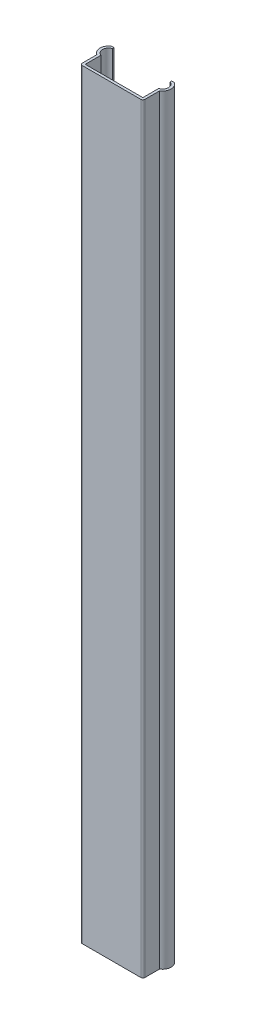
ISO-10303-21;
HEADER;
FILE_DESCRIPTION(('STEP AP214'),'2;1');
FILE_NAME('part.step','',(''),(''),'','','');
FILE_SCHEMA(('AUTOMOTIVE_DESIGN { 1 0 10303 214 1 1 1 1 }'));
ENDSEC;
DATA;
#1=APPLICATION_CONTEXT('core data for automotive mechanical design processes');
#2=APPLICATION_PROTOCOL_DEFINITION('international standard','automotive_design',2000,#1);
#3=PRODUCT_CONTEXT('',#1,'mechanical');
#4=PRODUCT('Part','Part','',(#3));
#5=PRODUCT_RELATED_PRODUCT_CATEGORY('part','',(#4));
#6=PRODUCT_DEFINITION_FORMATION('','',#4);
#7=PRODUCT_DEFINITION_CONTEXT('part definition',#1,'design');
#8=PRODUCT_DEFINITION('design','',#6,#7);
#9=PRODUCT_DEFINITION_SHAPE('','',#8);
#10=(LENGTH_UNIT() NAMED_UNIT(*) SI_UNIT(.MILLI.,.METRE.));
#11=(NAMED_UNIT(*) PLANE_ANGLE_UNIT() SI_UNIT($,.RADIAN.));
#12=(NAMED_UNIT(*) SI_UNIT($,.STERADIAN.) SOLID_ANGLE_UNIT());
#13=UNCERTAINTY_MEASURE_WITH_UNIT(LENGTH_MEASURE(1.E-05),#10,'distance_accuracy_value','');
#14=(GEOMETRIC_REPRESENTATION_CONTEXT(3) GLOBAL_UNCERTAINTY_ASSIGNED_CONTEXT((#13)) GLOBAL_UNIT_ASSIGNED_CONTEXT((#10,
#11,#12)) REPRESENTATION_CONTEXT('',''));
#15=CARTESIAN_POINT('',(0.,0.,0.));
#16=DIRECTION('',(0.,0.,1.));
#17=DIRECTION('',(1.,0.,0.));
#18=AXIS2_PLACEMENT_3D('',#15,#16,#17);
#19=CARTESIAN_POINT('',(-7.5,182.,0.));
#20=DIRECTION('',(1.,0.,0.));
#21=DIRECTION('',(0.,0.,-1.));
#22=AXIS2_PLACEMENT_3D('',#19,#20,#21);
#23=PLANE('',#22);
#24=DIRECTION('',(0.,0.,1.));
#25=VECTOR('',#24,1.);
#26=CARTESIAN_POINT('',(-7.5,0.,0.));
#27=LINE('',#26,#25);
#28=CARTESIAN_POINT('',(-7.5,0.,-4.));
#29=VERTEX_POINT('',#28);
#30=CARTESIAN_POINT('',(-7.5,0.,-0.499999999999999));
#31=VERTEX_POINT('',#30);
#32=EDGE_CURVE('E190',#29,#31,#27,.T.);
#33=ORIENTED_EDGE('',*,*,#32,.T.);
#34=DIRECTION('',(0.,-1.,0.));
#35=VECTOR('',#34,1.);
#36=CARTESIAN_POINT('',(-7.5,182.,-0.499999999999999));
#37=LINE('',#36,#35);
#38=CARTESIAN_POINT('',(-7.5,182.,-0.499999999999999));
#39=VERTEX_POINT('',#38);
#40=EDGE_CURVE('E53',#31,#39,#37,.F.);
#41=ORIENTED_EDGE('',*,*,#40,.T.);
#42=DIRECTION('',(0.,0.,1.));
#43=VECTOR('',#42,1.);
#44=CARTESIAN_POINT('',(-7.5,182.,0.));
#45=LINE('',#44,#43);
#46=CARTESIAN_POINT('',(-7.5,182.,-4.));
#47=VERTEX_POINT('',#46);
#48=EDGE_CURVE('E218',#47,#39,#45,.T.);
#49=ORIENTED_EDGE('',*,*,#48,.F.);
#50=DIRECTION('',(0.,-1.,0.));
#51=VECTOR('',#50,1.);
#52=CARTESIAN_POINT('',(-7.5,182.,-4.));
#53=LINE('',#52,#51);
#54=EDGE_CURVE('E189',#47,#29,#53,.T.);
#55=ORIENTED_EDGE('',*,*,#54,.T.);
#56=EDGE_LOOP('',(#33,#41,#49,#55));
#57=FACE_BOUND('',#56,.T.);
#58=ADVANCED_FACE('F30',(#57),#23,.F.);
#59=CARTESIAN_POINT('',(7.5,182.,0.));
#60=DIRECTION('',(0.,0.,-1.));
#61=DIRECTION('',(-1.,0.,0.));
#62=AXIS2_PLACEMENT_3D('',#59,#60,#61);
#63=PLANE('',#62);
#64=DIRECTION('',(1.,0.,0.));
#65=VECTOR('',#64,1.);
#66=CARTESIAN_POINT('',(7.5,182.,0.));
#67=LINE('',#66,#65);
#68=CARTESIAN_POINT('',(-7.,182.,0.));
#69=VERTEX_POINT('',#68);
#70=CARTESIAN_POINT('',(7.,182.,0.));
#71=VERTEX_POINT('',#70);
#72=EDGE_CURVE('E151',#69,#71,#67,.T.);
#73=ORIENTED_EDGE('',*,*,#72,.F.);
#74=DIRECTION('',(0.,-1.,0.));
#75=VECTOR('',#74,1.);
#76=CARTESIAN_POINT('',(-7.,182.,0.));
#77=LINE('',#76,#75);
#78=CARTESIAN_POINT('',(-7.,0.,0.));
#79=VERTEX_POINT('',#78);
#80=EDGE_CURVE('E250',#69,#79,#77,.T.);
#81=ORIENTED_EDGE('',*,*,#80,.T.);
#82=DIRECTION('',(1.,0.,0.));
#83=VECTOR('',#82,1.);
#84=CARTESIAN_POINT('',(7.5,0.,0.));
#85=LINE('',#84,#83);
#86=CARTESIAN_POINT('',(7.,0.,0.));
#87=VERTEX_POINT('',#86);
#88=EDGE_CURVE('E192',#79,#87,#85,.T.);
#89=ORIENTED_EDGE('',*,*,#88,.T.);
#90=DIRECTION('',(0.,-1.,0.));
#91=VECTOR('',#90,1.);
#92=CARTESIAN_POINT('',(7.,182.,0.));
#93=LINE('',#92,#91);
#94=EDGE_CURVE('E160',#87,#71,#93,.F.);
#95=ORIENTED_EDGE('',*,*,#94,.T.);
#96=EDGE_LOOP('',(#73,#81,#89,#95));
#97=FACE_BOUND('',#96,.T.);
#98=ADVANCED_FACE('F263',(#97),#63,.F.);
#99=CARTESIAN_POINT('',(7.5,182.,0.));
#100=DIRECTION('',(-1.,0.,0.));
#101=DIRECTION('',(0.,0.,1.));
#102=AXIS2_PLACEMENT_3D('',#99,#100,#101);
#103=PLANE('',#102);
#104=DIRECTION('',(0.,0.,-1.));
#105=VECTOR('',#104,1.);
#106=CARTESIAN_POINT('',(7.5,182.,0.));
#107=LINE('',#106,#105);
#108=CARTESIAN_POINT('',(7.5,182.,-0.499999999999999));
#109=VERTEX_POINT('',#108);
#110=CARTESIAN_POINT('',(7.5,182.,-4.));
#111=VERTEX_POINT('',#110);
#112=EDGE_CURVE('E143',#109,#111,#107,.T.);
#113=ORIENTED_EDGE('',*,*,#112,.F.);
#114=DIRECTION('',(0.,-1.,0.));
#115=VECTOR('',#114,1.);
#116=CARTESIAN_POINT('',(7.5,182.,-0.499999999999999));
#117=LINE('',#116,#115);
#118=CARTESIAN_POINT('',(7.5,0.,-0.499999999999999));
#119=VERTEX_POINT('',#118);
#120=EDGE_CURVE('E11',#109,#119,#117,.T.);
#121=ORIENTED_EDGE('',*,*,#120,.T.);
#122=DIRECTION('',(0.,0.,-1.));
#123=VECTOR('',#122,1.);
#124=CARTESIAN_POINT('',(7.5,0.,0.));
#125=LINE('',#124,#123);
#126=CARTESIAN_POINT('',(7.5,0.,-4.));
#127=VERTEX_POINT('',#126);
#128=EDGE_CURVE('E157',#119,#127,#125,.T.);
#129=ORIENTED_EDGE('',*,*,#128,.T.);
#130=DIRECTION('',(0.,-1.,0.));
#131=VECTOR('',#130,1.);
#132=CARTESIAN_POINT('',(7.5,182.,-4.));
#133=LINE('',#132,#131);
#134=EDGE_CURVE('E154',#111,#127,#133,.T.);
#135=ORIENTED_EDGE('',*,*,#134,.F.);
#136=EDGE_LOOP('',(#113,#121,#129,#135));
#137=FACE_BOUND('',#136,.T.);
#138=ADVANCED_FACE('F155',(#137),#103,.F.);
#139=CARTESIAN_POINT('',(6.46875,182.,-5.75));
#140=DIRECTION('',(0.,-1.,0.));
#141=DIRECTION('',(0.,0.,-1.));
#142=AXIS2_PLACEMENT_3D('',#139,#140,#141);
#143=CYLINDRICAL_SURFACE('',#142,2.03125);
#144=CARTESIAN_POINT('',(6.46875,0.,-5.75));
#145=DIRECTION('',(0.,1.,0.));
#146=DIRECTION('',(0.,0.,1.));
#147=AXIS2_PLACEMENT_3D('',#144,#145,#146);
#148=CIRCLE('',#147,2.03125);
#149=CARTESIAN_POINT('',(7.5,0.,-7.5));
#150=VERTEX_POINT('',#149);
#151=EDGE_CURVE('E196',#127,#150,#148,.T.);
#152=ORIENTED_EDGE('',*,*,#151,.T.);
#153=DIRECTION('',(0.,-1.,0.));
#154=VECTOR('',#153,1.);
#155=CARTESIAN_POINT('',(7.5,182.,-7.5));
#156=LINE('',#155,#154);
#157=CARTESIAN_POINT('',(7.5,182.,-7.5));
#158=VERTEX_POINT('',#157);
#159=EDGE_CURVE('E161',#158,#150,#156,.T.);
#160=ORIENTED_EDGE('',*,*,#159,.F.);
#161=CARTESIAN_POINT('',(6.46875,182.,-5.75));
#162=DIRECTION('',(0.,1.,0.));
#163=DIRECTION('',(0.,0.,1.));
#164=AXIS2_PLACEMENT_3D('',#161,#162,#163);
#165=CIRCLE('',#164,2.03125);
#166=EDGE_CURVE('E147',#111,#158,#165,.T.);
#167=ORIENTED_EDGE('',*,*,#166,.F.);
#168=ORIENTED_EDGE('',*,*,#134,.T.);
#169=EDGE_LOOP('',(#152,#160,#167,#168));
#170=FACE_BOUND('',#169,.T.);
#171=ADVANCED_FACE('F163',(#170),#143,.T.);
#172=CARTESIAN_POINT('',(7.5,182.,-7.5));
#173=DIRECTION('',(0.,0.,1.));
#174=DIRECTION('',(1.,0.,0.));
#175=AXIS2_PLACEMENT_3D('',#172,#173,#174);
#176=PLANE('',#175);
#177=DIRECTION('',(-1.,0.,0.));
#178=VECTOR('',#177,1.);
#179=CARTESIAN_POINT('',(7.5,0.,-7.5));
#180=LINE('',#179,#178);
#181=CARTESIAN_POINT('',(6.9,0.,-7.5));
#182=VERTEX_POINT('',#181);
#183=EDGE_CURVE('E198',#150,#182,#180,.T.);
#184=ORIENTED_EDGE('',*,*,#183,.T.);
#185=DIRECTION('',(0.,-1.,0.));
#186=VECTOR('',#185,1.);
#187=CARTESIAN_POINT('',(6.9,182.,-7.5));
#188=LINE('',#187,#186);
#189=CARTESIAN_POINT('',(6.9,182.,-7.5));
#190=VERTEX_POINT('',#189);
#191=EDGE_CURVE('E245',#190,#182,#188,.T.);
#192=ORIENTED_EDGE('',*,*,#191,.F.);
#193=DIRECTION('',(-1.,0.,0.));
#194=VECTOR('',#193,1.);
#195=CARTESIAN_POINT('',(7.5,182.,-7.5));
#196=LINE('',#195,#194);
#197=EDGE_CURVE('E166',#158,#190,#196,.T.);
#198=ORIENTED_EDGE('',*,*,#197,.F.);
#199=ORIENTED_EDGE('',*,*,#159,.T.);
#200=EDGE_LOOP('',(#184,#192,#198,#199));
#201=FACE_BOUND('',#200,.T.);
#202=ADVANCED_FACE('F318',(#201),#176,.F.);
#203=CARTESIAN_POINT('',(6.9,182.,-7.5));
#204=DIRECTION('',(1.,0.,0.));
#205=DIRECTION('',(0.,0.,-1.));
#206=AXIS2_PLACEMENT_3D('',#203,#204,#205);
#207=PLANE('',#206);
#208=DIRECTION('',(0.,0.,1.));
#209=VECTOR('',#208,1.);
#210=CARTESIAN_POINT('',(6.9,0.,-7.5));
#211=LINE('',#210,#209);
#212=CARTESIAN_POINT('',(6.9,0.,-7.11473440639562));
#213=VERTEX_POINT('',#212);
#214=EDGE_CURVE('E200',#182,#213,#211,.T.);
#215=ORIENTED_EDGE('',*,*,#214,.T.);
#216=DIRECTION('',(0.,-1.,0.));
#217=VECTOR('',#216,1.);
#218=CARTESIAN_POINT('',(6.9,182.,-7.11473440639562));
#219=LINE('',#218,#217);
#220=CARTESIAN_POINT('',(6.9,182.,-7.11473440639562));
#221=VERTEX_POINT('',#220);
#222=EDGE_CURVE('E242',#221,#213,#219,.T.);
#223=ORIENTED_EDGE('',*,*,#222,.F.);
#224=DIRECTION('',(0.,0.,1.));
#225=VECTOR('',#224,1.);
#226=CARTESIAN_POINT('',(6.9,182.,-7.5));
#227=LINE('',#226,#225);
#228=EDGE_CURVE('E168',#190,#221,#227,.T.);
#229=ORIENTED_EDGE('',*,*,#228,.F.);
#230=ORIENTED_EDGE('',*,*,#191,.T.);
#231=EDGE_LOOP('',(#215,#223,#229,#230));
#232=FACE_BOUND('',#231,.T.);
#233=ADVANCED_FACE('F315',(#232),#207,.F.);
#234=CARTESIAN_POINT('',(6.46875,182.,-5.75));
#235=DIRECTION('',(0.,-1.,0.));
#236=DIRECTION('',(0.,0.,-1.));
#237=AXIS2_PLACEMENT_3D('',#234,#235,#236);
#238=CYLINDRICAL_SURFACE('',#237,1.43125);
#239=CARTESIAN_POINT('',(6.46875,0.,-5.75));
#240=DIRECTION('',(0.,-1.,0.));
#241=DIRECTION('',(0.,0.,1.));
#242=AXIS2_PLACEMENT_3D('',#239,#240,#241);
#243=CIRCLE('',#242,1.43125);
#244=CARTESIAN_POINT('',(6.9,0.,-4.38526559360438));
#245=VERTEX_POINT('',#244);
#246=EDGE_CURVE('E202',#213,#245,#243,.T.);
#247=ORIENTED_EDGE('',*,*,#246,.T.);
#248=DIRECTION('',(0.,-1.,0.));
#249=VECTOR('',#248,1.);
#250=CARTESIAN_POINT('',(6.9,182.,-4.38526559360438));
#251=LINE('',#250,#249);
#252=CARTESIAN_POINT('',(6.9,182.,-4.38526559360438));
#253=VERTEX_POINT('',#252);
#254=EDGE_CURVE('E239',#253,#245,#251,.T.);
#255=ORIENTED_EDGE('',*,*,#254,.F.);
#256=CARTESIAN_POINT('',(6.46875,182.,-5.75));
#257=DIRECTION('',(0.,-1.,0.));
#258=DIRECTION('',(0.,0.,1.));
#259=AXIS2_PLACEMENT_3D('',#256,#257,#258);
#260=CIRCLE('',#259,1.43125);
#261=EDGE_CURVE('E173',#221,#253,#260,.T.);
#262=ORIENTED_EDGE('',*,*,#261,.F.);
#263=ORIENTED_EDGE('',*,*,#222,.T.);
#264=EDGE_LOOP('',(#247,#255,#262,#263));
#265=FACE_BOUND('',#264,.T.);
#266=ADVANCED_FACE('F310',(#265),#238,.F.);
#267=CARTESIAN_POINT('',(6.9,182.,-0.599999999999999));
#268=DIRECTION('',(1.,0.,0.));
#269=DIRECTION('',(0.,0.,-1.));
#270=AXIS2_PLACEMENT_3D('',#267,#268,#269);
#271=PLANE('',#270);
#272=DIRECTION('',(0.,0.,1.));
#273=VECTOR('',#272,1.);
#274=CARTESIAN_POINT('',(6.9,0.,-0.599999999999999));
#275=LINE('',#274,#273);
#276=CARTESIAN_POINT('',(6.9,0.,-0.599999999999999));
#277=VERTEX_POINT('',#276);
#278=EDGE_CURVE('E204',#245,#277,#275,.T.);
#279=ORIENTED_EDGE('',*,*,#278,.T.);
#280=DIRECTION('',(0.,-1.,0.));
#281=VECTOR('',#280,1.);
#282=CARTESIAN_POINT('',(6.9,182.,-0.599999999999999));
#283=LINE('',#282,#281);
#284=CARTESIAN_POINT('',(6.9,182.,-0.599999999999999));
#285=VERTEX_POINT('',#284);
#286=EDGE_CURVE('E236',#285,#277,#283,.T.);
#287=ORIENTED_EDGE('',*,*,#286,.F.);
#288=DIRECTION('',(0.,0.,1.));
#289=VECTOR('',#288,1.);
#290=CARTESIAN_POINT('',(6.9,182.,-0.599999999999999));
#291=LINE('',#290,#289);
#292=EDGE_CURVE('E175',#253,#285,#291,.T.);
#293=ORIENTED_EDGE('',*,*,#292,.F.);
#294=ORIENTED_EDGE('',*,*,#254,.T.);
#295=EDGE_LOOP('',(#279,#287,#293,#294));
#296=FACE_BOUND('',#295,.T.);
#297=ADVANCED_FACE('F304',(#296),#271,.F.);
#298=CARTESIAN_POINT('',(6.9,182.,-0.599999999999999));
#299=DIRECTION('',(0.,0.,1.));
#300=DIRECTION('',(1.,0.,0.));
#301=AXIS2_PLACEMENT_3D('',#298,#299,#300);
#302=PLANE('',#301);
#303=DIRECTION('',(-1.,0.,0.));
#304=VECTOR('',#303,1.);
#305=CARTESIAN_POINT('',(6.9,0.,-0.599999999999999));
#306=LINE('',#305,#304);
#307=CARTESIAN_POINT('',(-6.9,0.,-0.599999999999999));
#308=VERTEX_POINT('',#307);
#309=EDGE_CURVE('E206',#277,#308,#306,.T.);
#310=ORIENTED_EDGE('',*,*,#309,.T.);
#311=DIRECTION('',(0.,-1.,0.));
#312=VECTOR('',#311,1.);
#313=CARTESIAN_POINT('',(-6.9,182.,-0.599999999999999));
#314=LINE('',#313,#312);
#315=CARTESIAN_POINT('',(-6.9,182.,-0.599999999999999));
#316=VERTEX_POINT('',#315);
#317=EDGE_CURVE('E233',#316,#308,#314,.T.);
#318=ORIENTED_EDGE('',*,*,#317,.F.);
#319=DIRECTION('',(-1.,0.,0.));
#320=VECTOR('',#319,1.);
#321=CARTESIAN_POINT('',(6.9,182.,-0.599999999999999));
#322=LINE('',#321,#320);
#323=EDGE_CURVE('E177',#285,#316,#322,.T.);
#324=ORIENTED_EDGE('',*,*,#323,.F.);
#325=ORIENTED_EDGE('',*,*,#286,.T.);
#326=EDGE_LOOP('',(#310,#318,#324,#325));
#327=FACE_BOUND('',#326,.T.);
#328=ADVANCED_FACE('F300',(#327),#302,.F.);
#329=CARTESIAN_POINT('',(-6.9,182.,-0.599999999999999));
#330=DIRECTION('',(-1.,0.,0.));
#331=DIRECTION('',(0.,0.,1.));
#332=AXIS2_PLACEMENT_3D('',#329,#330,#331);
#333=PLANE('',#332);
#334=DIRECTION('',(0.,0.,-1.));
#335=VECTOR('',#334,1.);
#336=CARTESIAN_POINT('',(-6.9,0.,-0.599999999999999));
#337=LINE('',#336,#335);
#338=CARTESIAN_POINT('',(-6.9,0.,-4.38526559360438));
#339=VERTEX_POINT('',#338);
#340=EDGE_CURVE('E208',#308,#339,#337,.T.);
#341=ORIENTED_EDGE('',*,*,#340,.T.);
#342=DIRECTION('',(0.,-1.,0.));
#343=VECTOR('',#342,1.);
#344=CARTESIAN_POINT('',(-6.9,182.,-4.38526559360438));
#345=LINE('',#344,#343);
#346=CARTESIAN_POINT('',(-6.9,182.,-4.38526559360438));
#347=VERTEX_POINT('',#346);
#348=EDGE_CURVE('E230',#347,#339,#345,.T.);
#349=ORIENTED_EDGE('',*,*,#348,.F.);
#350=DIRECTION('',(0.,0.,-1.));
#351=VECTOR('',#350,1.);
#352=CARTESIAN_POINT('',(-6.9,182.,-0.599999999999999));
#353=LINE('',#352,#351);
#354=EDGE_CURVE('E179',#316,#347,#353,.T.);
#355=ORIENTED_EDGE('',*,*,#354,.F.);
#356=ORIENTED_EDGE('',*,*,#317,.T.);
#357=EDGE_LOOP('',(#341,#349,#355,#356));
#358=FACE_BOUND('',#357,.T.);
#359=ADVANCED_FACE('F295',(#358),#333,.F.);
#360=CARTESIAN_POINT('',(-6.46875,182.,-5.75));
#361=DIRECTION('',(0.,-1.,0.));
#362=DIRECTION('',(0.,0.,-1.));
#363=AXIS2_PLACEMENT_3D('',#360,#361,#362);
#364=CYLINDRICAL_SURFACE('',#363,1.43125);
#365=CARTESIAN_POINT('',(-6.46875,0.,-5.75));
#366=DIRECTION('',(0.,-1.,0.));
#367=DIRECTION('',(0.,0.,-1.));
#368=AXIS2_PLACEMENT_3D('',#365,#366,#367);
#369=CIRCLE('',#368,1.43125);
#370=CARTESIAN_POINT('',(-6.9,0.,-7.11473440639562));
#371=VERTEX_POINT('',#370);
#372=EDGE_CURVE('E210',#339,#371,#369,.T.);
#373=ORIENTED_EDGE('',*,*,#372,.T.);
#374=DIRECTION('',(0.,-1.,0.));
#375=VECTOR('',#374,1.);
#376=CARTESIAN_POINT('',(-6.9,182.,-7.11473440639562));
#377=LINE('',#376,#375);
#378=CARTESIAN_POINT('',(-6.9,182.,-7.11473440639562));
#379=VERTEX_POINT('',#378);
#380=EDGE_CURVE('E227',#379,#371,#377,.T.);
#381=ORIENTED_EDGE('',*,*,#380,.F.);
#382=CARTESIAN_POINT('',(-6.46875,182.,-5.75));
#383=DIRECTION('',(0.,-1.,0.));
#384=DIRECTION('',(0.,0.,-1.));
#385=AXIS2_PLACEMENT_3D('',#382,#383,#384);
#386=CIRCLE('',#385,1.43125);
#387=EDGE_CURVE('E181',#347,#379,#386,.T.);
#388=ORIENTED_EDGE('',*,*,#387,.F.);
#389=ORIENTED_EDGE('',*,*,#348,.T.);
#390=EDGE_LOOP('',(#373,#381,#388,#389));
#391=FACE_BOUND('',#390,.T.);
#392=ADVANCED_FACE('F289',(#391),#364,.F.);
#393=CARTESIAN_POINT('',(-6.9,182.,-7.5));
#394=DIRECTION('',(-1.,0.,0.));
#395=DIRECTION('',(0.,0.,1.));
#396=AXIS2_PLACEMENT_3D('',#393,#394,#395);
#397=PLANE('',#396);
#398=DIRECTION('',(0.,0.,-1.));
#399=VECTOR('',#398,1.);
#400=CARTESIAN_POINT('',(-6.9,0.,-7.5));
#401=LINE('',#400,#399);
#402=CARTESIAN_POINT('',(-6.9,0.,-7.5));
#403=VERTEX_POINT('',#402);
#404=EDGE_CURVE('E212',#371,#403,#401,.T.);
#405=ORIENTED_EDGE('',*,*,#404,.T.);
#406=DIRECTION('',(0.,-1.,0.));
#407=VECTOR('',#406,1.);
#408=CARTESIAN_POINT('',(-6.9,182.,-7.5));
#409=LINE('',#408,#407);
#410=CARTESIAN_POINT('',(-6.9,182.,-7.5));
#411=VERTEX_POINT('',#410);
#412=EDGE_CURVE('E224',#411,#403,#409,.T.);
#413=ORIENTED_EDGE('',*,*,#412,.F.);
#414=DIRECTION('',(0.,0.,-1.));
#415=VECTOR('',#414,1.);
#416=CARTESIAN_POINT('',(-6.9,182.,-7.5));
#417=LINE('',#416,#415);
#418=EDGE_CURVE('E183',#379,#411,#417,.T.);
#419=ORIENTED_EDGE('',*,*,#418,.F.);
#420=ORIENTED_EDGE('',*,*,#380,.T.);
#421=EDGE_LOOP('',(#405,#413,#419,#420));
#422=FACE_BOUND('',#421,.T.);
#423=ADVANCED_FACE('F285',(#422),#397,.F.);
#424=CARTESIAN_POINT('',(-7.5,182.,-7.5));
#425=DIRECTION('',(0.,0.,1.));
#426=DIRECTION('',(1.,0.,0.));
#427=AXIS2_PLACEMENT_3D('',#424,#425,#426);
#428=PLANE('',#427);
#429=DIRECTION('',(-1.,0.,0.));
#430=VECTOR('',#429,1.);
#431=CARTESIAN_POINT('',(-7.5,0.,-7.5));
#432=LINE('',#431,#430);
#433=CARTESIAN_POINT('',(-7.5,0.,-7.5));
#434=VERTEX_POINT('',#433);
#435=EDGE_CURVE('E214',#403,#434,#432,.T.);
#436=ORIENTED_EDGE('',*,*,#435,.T.);
#437=DIRECTION('',(0.,-1.,0.));
#438=VECTOR('',#437,1.);
#439=CARTESIAN_POINT('',(-7.5,182.,-7.5));
#440=LINE('',#439,#438);
#441=CARTESIAN_POINT('',(-7.5,182.,-7.5));
#442=VERTEX_POINT('',#441);
#443=EDGE_CURVE('E221',#442,#434,#440,.T.);
#444=ORIENTED_EDGE('',*,*,#443,.F.);
#445=DIRECTION('',(-1.,0.,0.));
#446=VECTOR('',#445,1.);
#447=CARTESIAN_POINT('',(-7.5,182.,-7.5));
#448=LINE('',#447,#446);
#449=EDGE_CURVE('E185',#411,#442,#448,.T.);
#450=ORIENTED_EDGE('',*,*,#449,.F.);
#451=ORIENTED_EDGE('',*,*,#412,.T.);
#452=EDGE_LOOP('',(#436,#444,#450,#451));
#453=FACE_BOUND('',#452,.T.);
#454=ADVANCED_FACE('F280',(#453),#428,.F.);
#455=CARTESIAN_POINT('',(-6.46875,182.,-5.75));
#456=DIRECTION('',(0.,-1.,0.));
#457=DIRECTION('',(0.,0.,-1.));
#458=AXIS2_PLACEMENT_3D('',#455,#456,#457);
#459=CYLINDRICAL_SURFACE('',#458,2.03125);
#460=CARTESIAN_POINT('',(-6.46875,0.,-5.75));
#461=DIRECTION('',(0.,1.,0.));
#462=DIRECTION('',(0.,0.,-1.));
#463=AXIS2_PLACEMENT_3D('',#460,#461,#462);
#464=CIRCLE('',#463,2.03125);
#465=EDGE_CURVE('E216',#434,#29,#464,.T.);
#466=ORIENTED_EDGE('',*,*,#465,.T.);
#467=ORIENTED_EDGE('',*,*,#54,.F.);
#468=CARTESIAN_POINT('',(-6.46875,182.,-5.75));
#469=DIRECTION('',(0.,1.,0.));
#470=DIRECTION('',(0.,0.,-1.));
#471=AXIS2_PLACEMENT_3D('',#468,#469,#470);
#472=CIRCLE('',#471,2.03125);
#473=EDGE_CURVE('E187',#442,#47,#472,.T.);
#474=ORIENTED_EDGE('',*,*,#473,.F.);
#475=ORIENTED_EDGE('',*,*,#443,.T.);
#476=EDGE_LOOP('',(#466,#467,#474,#475));
#477=FACE_BOUND('',#476,.T.);
#478=ADVANCED_FACE('F274',(#477),#459,.T.);
#479=CARTESIAN_POINT('',(-6.46875,182.,-5.75));
#480=DIRECTION('',(0.,-1.,0.));
#481=DIRECTION('',(0.,0.,-1.));
#482=AXIS2_PLACEMENT_3D('',#479,#480,#481);
#483=PLANE('',#482);
#484=ORIENTED_EDGE('',*,*,#48,.T.);
#485=CARTESIAN_POINT('',(-7.,182.,-0.499999999999999));
#486=DIRECTION('',(0.,-1.,0.));
#487=DIRECTION('',(0.,0.,-1.));
#488=AXIS2_PLACEMENT_3D('',#485,#486,#487);
#489=CIRCLE('',#488,0.5);
#490=EDGE_CURVE('E38',#39,#69,#489,.F.);
#491=ORIENTED_EDGE('',*,*,#490,.T.);
#492=ORIENTED_EDGE('',*,*,#72,.T.);
#493=CARTESIAN_POINT('',(7.,182.,-0.499999999999999));
#494=DIRECTION('',(0.,-1.,0.));
#495=DIRECTION('',(0.,0.,-1.));
#496=AXIS2_PLACEMENT_3D('',#493,#494,#495);
#497=CIRCLE('',#496,0.5);
#498=EDGE_CURVE('E45',#71,#109,#497,.F.);
#499=ORIENTED_EDGE('',*,*,#498,.T.);
#500=ORIENTED_EDGE('',*,*,#112,.T.);
#501=ORIENTED_EDGE('',*,*,#166,.T.);
#502=ORIENTED_EDGE('',*,*,#197,.T.);
#503=ORIENTED_EDGE('',*,*,#228,.T.);
#504=ORIENTED_EDGE('',*,*,#261,.T.);
#505=ORIENTED_EDGE('',*,*,#292,.T.);
#506=ORIENTED_EDGE('',*,*,#323,.T.);
#507=ORIENTED_EDGE('',*,*,#354,.T.);
#508=ORIENTED_EDGE('',*,*,#387,.T.);
#509=ORIENTED_EDGE('',*,*,#418,.T.);
#510=ORIENTED_EDGE('',*,*,#449,.T.);
#511=ORIENTED_EDGE('',*,*,#473,.T.);
#512=EDGE_LOOP('',(#484,#491,#492,#499,#500,#501,#502,#503,#504,#505,#506,#507,#508,#509,#510,#511));
#513=FACE_BOUND('',#512,.T.);
#514=ADVANCED_FACE('F145',(#513),#483,.F.);
#515=CARTESIAN_POINT('',(-6.46875,0.,-5.75));
#516=DIRECTION('',(0.,-1.,0.));
#517=DIRECTION('',(0.,0.,-1.));
#518=AXIS2_PLACEMENT_3D('',#515,#516,#517);
#519=PLANE('',#518);
#520=ORIENTED_EDGE('',*,*,#88,.F.);
#521=CARTESIAN_POINT('',(-7.,0.,-0.499999999999999));
#522=DIRECTION('',(0.,-1.,0.));
#523=DIRECTION('',(0.,0.,-1.));
#524=AXIS2_PLACEMENT_3D('',#521,#522,#523);
#525=CIRCLE('',#524,0.5);
#526=EDGE_CURVE('E255',#79,#31,#525,.T.);
#527=ORIENTED_EDGE('',*,*,#526,.T.);
#528=ORIENTED_EDGE('',*,*,#32,.F.);
#529=ORIENTED_EDGE('',*,*,#465,.F.);
#530=ORIENTED_EDGE('',*,*,#435,.F.);
#531=ORIENTED_EDGE('',*,*,#404,.F.);
#532=ORIENTED_EDGE('',*,*,#372,.F.);
#533=ORIENTED_EDGE('',*,*,#340,.F.);
#534=ORIENTED_EDGE('',*,*,#309,.F.);
#535=ORIENTED_EDGE('',*,*,#278,.F.);
#536=ORIENTED_EDGE('',*,*,#246,.F.);
#537=ORIENTED_EDGE('',*,*,#214,.F.);
#538=ORIENTED_EDGE('',*,*,#183,.F.);
#539=ORIENTED_EDGE('',*,*,#151,.F.);
#540=ORIENTED_EDGE('',*,*,#128,.F.);
#541=CARTESIAN_POINT('',(7.,0.,-0.499999999999999));
#542=DIRECTION('',(0.,-1.,0.));
#543=DIRECTION('',(0.,0.,-1.));
#544=AXIS2_PLACEMENT_3D('',#541,#542,#543);
#545=CIRCLE('',#544,0.5);
#546=EDGE_CURVE('E253',#119,#87,#545,.T.);
#547=ORIENTED_EDGE('',*,*,#546,.T.);
#548=EDGE_LOOP('',(#520,#527,#528,#529,#530,#531,#532,#533,#534,#535,#536,#537,#538,#539,#540,#547));
#549=FACE_BOUND('',#548,.T.);
#550=ADVANCED_FACE('F269',(#549),#519,.T.);
#551=CARTESIAN_POINT('',(-7.,182.,-0.499999999999999));
#552=DIRECTION('',(0.,-1.,0.));
#553=DIRECTION('',(0.,0.,-1.));
#554=AXIS2_PLACEMENT_3D('',#551,#552,#553);
#555=CYLINDRICAL_SURFACE('',#554,0.5);
#556=ORIENTED_EDGE('',*,*,#490,.F.);
#557=ORIENTED_EDGE('',*,*,#40,.F.);
#558=ORIENTED_EDGE('',*,*,#526,.F.);
#559=ORIENTED_EDGE('',*,*,#80,.F.);
#560=EDGE_LOOP('',(#556,#557,#558,#559));
#561=FACE_BOUND('',#560,.T.);
#562=ADVANCED_FACE('F266',(#561),#555,.T.);
#563=CARTESIAN_POINT('',(7.,182.,-0.499999999999999));
#564=DIRECTION('',(0.,-1.,0.));
#565=DIRECTION('',(0.,0.,-1.));
#566=AXIS2_PLACEMENT_3D('',#563,#564,#565);
#567=CYLINDRICAL_SURFACE('',#566,0.5);
#568=ORIENTED_EDGE('',*,*,#498,.F.);
#569=ORIENTED_EDGE('',*,*,#94,.F.);
#570=ORIENTED_EDGE('',*,*,#546,.F.);
#571=ORIENTED_EDGE('',*,*,#120,.F.);
#572=EDGE_LOOP('',(#568,#569,#570,#571));
#573=FACE_BOUND('',#572,.T.);
#574=ADVANCED_FACE('F32',(#573),#567,.T.);
#575=CLOSED_SHELL('',(#58,#98,#138,#171,#202,#233,#266,#297,#328,#359,#392,#423,#454,#478,#514,
#550,#562,#574));
#576=MANIFOLD_SOLID_BREP('B2',#575);
#577=ADVANCED_BREP_SHAPE_REPRESENTATION('',(#18,#576),#14);
#578=SHAPE_DEFINITION_REPRESENTATION(#9,#577);
ENDSEC;
END-ISO-10303-21;
